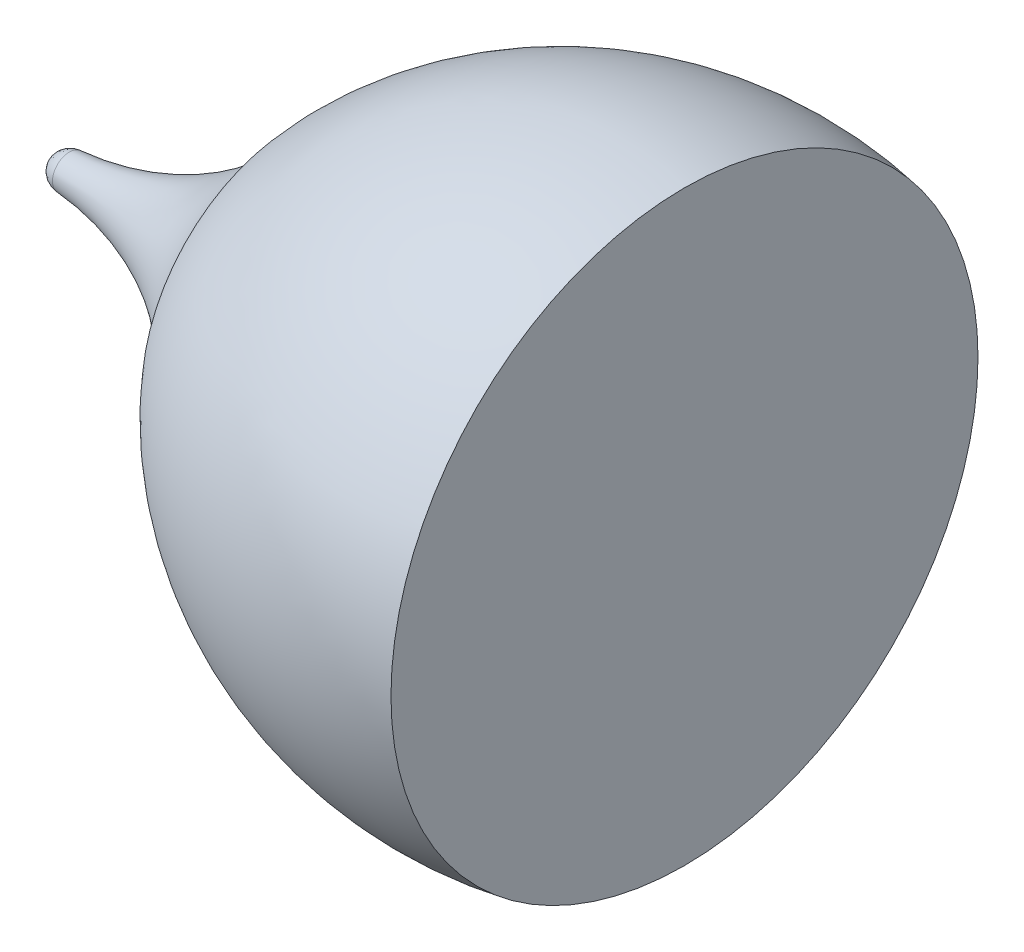
ISO-10303-21;
HEADER;
FILE_DESCRIPTION(('STEP AP214'),'2;1');
FILE_NAME('part.step','',(''),(''),'','','');
FILE_SCHEMA(('AUTOMOTIVE_DESIGN { 1 0 10303 214 1 1 1 1 }'));
ENDSEC;
DATA;
#1=APPLICATION_CONTEXT('core data for automotive mechanical design processes');
#2=APPLICATION_PROTOCOL_DEFINITION('international standard','automotive_design',2000,#1);
#3=PRODUCT_CONTEXT('',#1,'mechanical');
#4=PRODUCT('Part','Part','',(#3));
#5=PRODUCT_RELATED_PRODUCT_CATEGORY('part','',(#4));
#6=PRODUCT_DEFINITION_FORMATION('','',#4);
#7=PRODUCT_DEFINITION_CONTEXT('part definition',#1,'design');
#8=PRODUCT_DEFINITION('design','',#6,#7);
#9=PRODUCT_DEFINITION_SHAPE('','',#8);
#10=(LENGTH_UNIT() NAMED_UNIT(*) SI_UNIT(.MILLI.,.METRE.));
#11=(NAMED_UNIT(*) PLANE_ANGLE_UNIT() SI_UNIT($,.RADIAN.));
#12=(NAMED_UNIT(*) SI_UNIT($,.STERADIAN.) SOLID_ANGLE_UNIT());
#13=UNCERTAINTY_MEASURE_WITH_UNIT(LENGTH_MEASURE(1.E-05),#10,'distance_accuracy_value','');
#14=(GEOMETRIC_REPRESENTATION_CONTEXT(3) GLOBAL_UNCERTAINTY_ASSIGNED_CONTEXT((#13)) GLOBAL_UNIT_ASSIGNED_CONTEXT((#10,
#11,#12)) REPRESENTATION_CONTEXT('',''));
#15=CARTESIAN_POINT('',(0.,0.,0.));
#16=DIRECTION('',(0.,0.,1.));
#17=DIRECTION('',(1.,0.,0.));
#18=AXIS2_PLACEMENT_3D('',#15,#16,#17);
#19=CARTESIAN_POINT('',(-39.2006242683037,5.10041661378747,0.));
#20=DIRECTION('',(-1.,0.,0.));
#21=DIRECTION('',(0.,0.,1.));
#22=AXIS2_PLACEMENT_3D('',#19,#20,#21);
#23=TOROIDAL_SURFACE('',#22,10.783787031609,10.2136199148117);
#24=CARTESIAN_POINT('',(-38.4937585415938,5.10041661378747,0.));
#25=DIRECTION('',(-1.,0.,0.));
#26=DIRECTION('',(0.,0.,1.));
#27=AXIS2_PLACEMENT_3D('',#24,#25,#26);
#28=CIRCLE('',#27,0.594656911297455);
#29=CARTESIAN_POINT('',(-38.4937585415938,5.10041661378747,0.594656911297455));
#30=VERTEX_POINT('',#29);
#31=EDGE_CURVE('E52',#30,#30,#28,.T.);
#32=ORIENTED_EDGE('',*,*,#31,.F.);
#33=EDGE_LOOP('',(#32));
#34=FACE_BOUND('',#33,.T.);
#35=CARTESIAN_POINT('',(-30.4988829413446,5.10041661378747,0.));
#36=DIRECTION('',(-1.,0.,0.));
#37=DIRECTION('',(0.,0.,1.));
#38=AXIS2_PLACEMENT_3D('',#35,#36,#37);
#39=CIRCLE('',#38,5.43610251932424);
#40=CARTESIAN_POINT('',(-30.4988829413446,5.10041661378747,5.43610251932424));
#41=VERTEX_POINT('',#40);
#42=EDGE_CURVE('E11',#41,#41,#39,.T.);
#43=ORIENTED_EDGE('',*,*,#42,.T.);
#44=EDGE_LOOP('',(#43));
#45=FACE_BOUND('',#44,.T.);
#46=ADVANCED_FACE('F36',(#34,#45),#23,.F.);
#47=CARTESIAN_POINT('',(-19.3833387225102,5.10041661378747,0.));
#48=DIRECTION('',(-1.,0.,0.));
#49=DIRECTION('',(0.,0.,1.));
#50=AXIS2_PLACEMENT_3D('',#47,#48,#49);
#51=DEGENERATE_TOROIDAL_SURFACE('',#50,4.01815668295163,14.5924069414433,.F.);
#52=ORIENTED_EDGE('',*,*,#42,.F.);
#53=EDGE_LOOP('',(#52));
#54=FACE_BOUND('',#53,.T.);
#55=CARTESIAN_POINT('',(-16.8103310234297,5.10041661378747,0.));
#56=DIRECTION('',(-1.,0.,0.));
#57=DIRECTION('',(0.,0.,1.));
#58=AXIS2_PLACEMENT_3D('',#55,#56,#57);
#59=CIRCLE('',#58,10.3456162101693);
#60=CARTESIAN_POINT('',(-16.8103310234297,5.10041661378747,10.3456162101693));
#61=VERTEX_POINT('',#60);
#62=EDGE_CURVE('E42',#61,#61,#59,.T.);
#63=ORIENTED_EDGE('',*,*,#62,.T.);
#64=EDGE_LOOP('',(#63));
#65=FACE_BOUND('',#64,.T.);
#66=ADVANCED_FACE('F58',(#54,#65),#51,.F.);
#67=CARTESIAN_POINT('',(-16.8103310234297,5.10041661378747,0.));
#68=DIRECTION('',(-1.,0.,0.));
#69=DIRECTION('',(0.,0.,1.));
#70=AXIS2_PLACEMENT_3D('',#67,#68,#69);
#71=PLANE('',#70);
#72=ORIENTED_EDGE('',*,*,#62,.F.);
#73=EDGE_LOOP('',(#72));
#74=FACE_BOUND('',#73,.T.);
#75=ADVANCED_FACE('F48',(#74),#71,.F.);
#76=CARTESIAN_POINT('',(-38.4485290683518,5.10041661378747,-0.0573042331204468));
#77=DIRECTION('',(0.,-1.,0.));
#78=DIRECTION('',(0.,0.,1.));
#79=AXIS2_PLACEMENT_3D('',#76,#77,#78);
#80=CIRCLE('',#79,0.653528147121795);
#81=TRIMMED_CURVE('',#80,(PARAMETER_VALUE(-1.48299916037957)),
(PARAMETER_VALUE(1.48299916037957)),.T.,.PARAMETER.);
#82=CARTESIAN_POINT('',(-38.4485290683518,5.10041661378747,0.));
#83=DIRECTION('',(-1.,0.,0.));
#84=AXIS1_PLACEMENT('',#82,#83);
#85=SURFACE_OF_REVOLUTION('',#81,#84);
#86=CARTESIAN_POINT('',(-39.099540023672,5.10041661378747,0.));
#87=VERTEX_POINT('',#86);
#88=VERTEX_LOOP('',#87);
#89=FACE_BOUND('',#88,.T.);
#90=ORIENTED_EDGE('',*,*,#31,.T.);
#91=EDGE_LOOP('',(#90));
#92=FACE_BOUND('',#91,.T.);
#93=ADVANCED_FACE('F45',(#89,#92),#85,.T.);
#94=CLOSED_SHELL('',(#46,#66,#75,#93));
#95=MANIFOLD_SOLID_BREP('B2',#94);
#96=ADVANCED_BREP_SHAPE_REPRESENTATION('',(#18,#95),#14);
#97=SHAPE_DEFINITION_REPRESENTATION(#9,#96);
ENDSEC;
END-ISO-10303-21;
